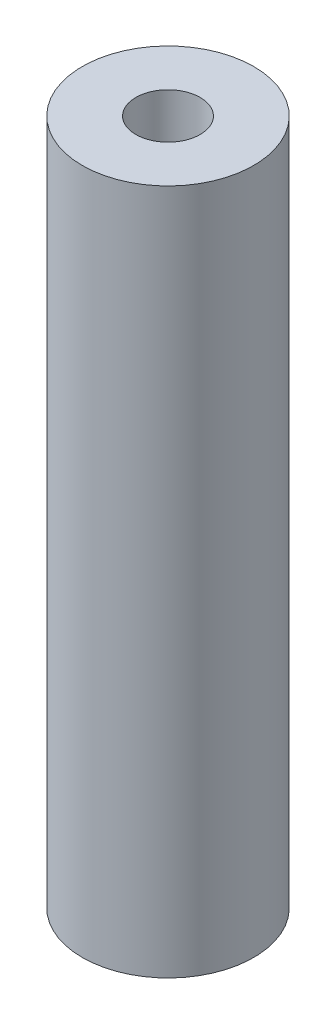
ISO-10303-21;
HEADER;
FILE_DESCRIPTION(('STEP AP214'),'2;1');
FILE_NAME('part.step','',(''),(''),'','','');
FILE_SCHEMA(('AUTOMOTIVE_DESIGN { 1 0 10303 214 1 1 1 1 }'));
ENDSEC;
DATA;
#1=APPLICATION_CONTEXT('core data for automotive mechanical design processes');
#2=APPLICATION_PROTOCOL_DEFINITION('international standard','automotive_design',2000,#1);
#3=PRODUCT_CONTEXT('',#1,'mechanical');
#4=PRODUCT('Part','Part','',(#3));
#5=PRODUCT_RELATED_PRODUCT_CATEGORY('part','',(#4));
#6=PRODUCT_DEFINITION_FORMATION('','',#4);
#7=PRODUCT_DEFINITION_CONTEXT('part definition',#1,'design');
#8=PRODUCT_DEFINITION('design','',#6,#7);
#9=PRODUCT_DEFINITION_SHAPE('','',#8);
#10=(LENGTH_UNIT() NAMED_UNIT(*) SI_UNIT(.MILLI.,.METRE.));
#11=(NAMED_UNIT(*) PLANE_ANGLE_UNIT() SI_UNIT($,.RADIAN.));
#12=(NAMED_UNIT(*) SI_UNIT($,.STERADIAN.) SOLID_ANGLE_UNIT());
#13=UNCERTAINTY_MEASURE_WITH_UNIT(LENGTH_MEASURE(1.E-05),#10,'distance_accuracy_value','');
#14=(GEOMETRIC_REPRESENTATION_CONTEXT(3) GLOBAL_UNCERTAINTY_ASSIGNED_CONTEXT((#13)) GLOBAL_UNIT_ASSIGNED_CONTEXT((#10,
#11,#12)) REPRESENTATION_CONTEXT('',''));
#15=CARTESIAN_POINT('',(0.,0.,0.));
#16=DIRECTION('',(0.,0.,1.));
#17=DIRECTION('',(1.,0.,0.));
#18=AXIS2_PLACEMENT_3D('',#15,#16,#17);
#19=CARTESIAN_POINT('',(0.,101.6,0.));
#20=DIRECTION('',(0.,1.,0.));
#21=DIRECTION('',(0.,0.,-1.));
#22=AXIS2_PLACEMENT_3D('',#19,#20,#21);
#23=PLANE('',#22);
#24=CARTESIAN_POINT('',(0.,101.6,0.));
#25=DIRECTION('',(0.,-1.,0.));
#26=DIRECTION('',(0.,0.,-1.));
#27=AXIS2_PLACEMENT_3D('',#24,#25,#26);
#28=CIRCLE('',#27,12.7);
#29=CARTESIAN_POINT('',(0.,101.6,-12.7));
#30=VERTEX_POINT('',#29);
#31=EDGE_CURVE('E10',#30,#30,#28,.T.);
#32=ORIENTED_EDGE('',*,*,#31,.F.);
#33=EDGE_LOOP('',(#32));
#34=FACE_BOUND('',#33,.T.);
#35=CARTESIAN_POINT('',(0.,101.6,0.));
#36=DIRECTION('',(0.,-1.,0.));
#37=DIRECTION('',(0.,0.,-1.));
#38=AXIS2_PLACEMENT_3D('',#35,#36,#37);
#39=CIRCLE('',#38,4.7625);
#40=CARTESIAN_POINT('',(0.,101.6,-4.7625));
#41=VERTEX_POINT('',#40);
#42=EDGE_CURVE('E43',#41,#41,#39,.T.);
#43=ORIENTED_EDGE('',*,*,#42,.T.);
#44=EDGE_LOOP('',(#43));
#45=FACE_BOUND('',#44,.T.);
#46=ADVANCED_FACE('F32',(#34,#45),#23,.T.);
#47=CARTESIAN_POINT('',(0.,0.,0.));
#48=DIRECTION('',(0.,1.,0.));
#49=DIRECTION('',(0.,0.,-1.));
#50=AXIS2_PLACEMENT_3D('',#47,#48,#49);
#51=PLANE('',#50);
#52=CARTESIAN_POINT('',(0.,0.,0.));
#53=DIRECTION('',(0.,-1.,0.));
#54=DIRECTION('',(0.,0.,-1.));
#55=AXIS2_PLACEMENT_3D('',#52,#53,#54);
#56=CIRCLE('',#55,12.7);
#57=CARTESIAN_POINT('',(0.,0.,-12.7));
#58=VERTEX_POINT('',#57);
#59=EDGE_CURVE('E36',#58,#58,#56,.T.);
#60=ORIENTED_EDGE('',*,*,#59,.T.);
#61=EDGE_LOOP('',(#60));
#62=FACE_BOUND('',#61,.T.);
#63=CARTESIAN_POINT('',(0.,0.,0.));
#64=DIRECTION('',(0.,-1.,0.));
#65=DIRECTION('',(0.,0.,-1.));
#66=AXIS2_PLACEMENT_3D('',#63,#64,#65);
#67=CIRCLE('',#66,4.7625);
#68=CARTESIAN_POINT('',(0.,0.,-4.7625));
#69=VERTEX_POINT('',#68);
#70=EDGE_CURVE('E45',#69,#69,#67,.T.);
#71=ORIENTED_EDGE('',*,*,#70,.F.);
#72=EDGE_LOOP('',(#71));
#73=FACE_BOUND('',#72,.T.);
#74=ADVANCED_FACE('F58',(#62,#73),#51,.F.);
#75=CARTESIAN_POINT('',(0.,101.6,0.));
#76=DIRECTION('',(0.,-1.,0.));
#77=DIRECTION('',(0.,0.,1.));
#78=AXIS2_PLACEMENT_3D('',#75,#76,#77);
#79=CYLINDRICAL_SURFACE('',#78,12.7);
#80=ORIENTED_EDGE('',*,*,#31,.T.);
#81=EDGE_LOOP('',(#80));
#82=FACE_BOUND('',#81,.T.);
#83=ORIENTED_EDGE('',*,*,#59,.F.);
#84=EDGE_LOOP('',(#83));
#85=FACE_BOUND('',#84,.T.);
#86=ADVANCED_FACE('F34',(#82,#85),#79,.T.);
#87=CARTESIAN_POINT('',(0.,101.6,0.));
#88=DIRECTION('',(0.,-1.,0.));
#89=DIRECTION('',(0.,0.,1.));
#90=AXIS2_PLACEMENT_3D('',#87,#88,#89);
#91=CYLINDRICAL_SURFACE('',#90,4.7625);
#92=ORIENTED_EDGE('',*,*,#42,.F.);
#93=EDGE_LOOP('',(#92));
#94=FACE_BOUND('',#93,.T.);
#95=ORIENTED_EDGE('',*,*,#70,.T.);
#96=EDGE_LOOP('',(#95));
#97=FACE_BOUND('',#96,.T.);
#98=ADVANCED_FACE('F52',(#94,#97),#91,.F.);
#99=CLOSED_SHELL('',(#46,#74,#86,#98));
#100=MANIFOLD_SOLID_BREP('B2',#99);
#101=ADVANCED_BREP_SHAPE_REPRESENTATION('',(#18,#100),#14);
#102=SHAPE_DEFINITION_REPRESENTATION(#9,#101);
ENDSEC;
END-ISO-10303-21;
